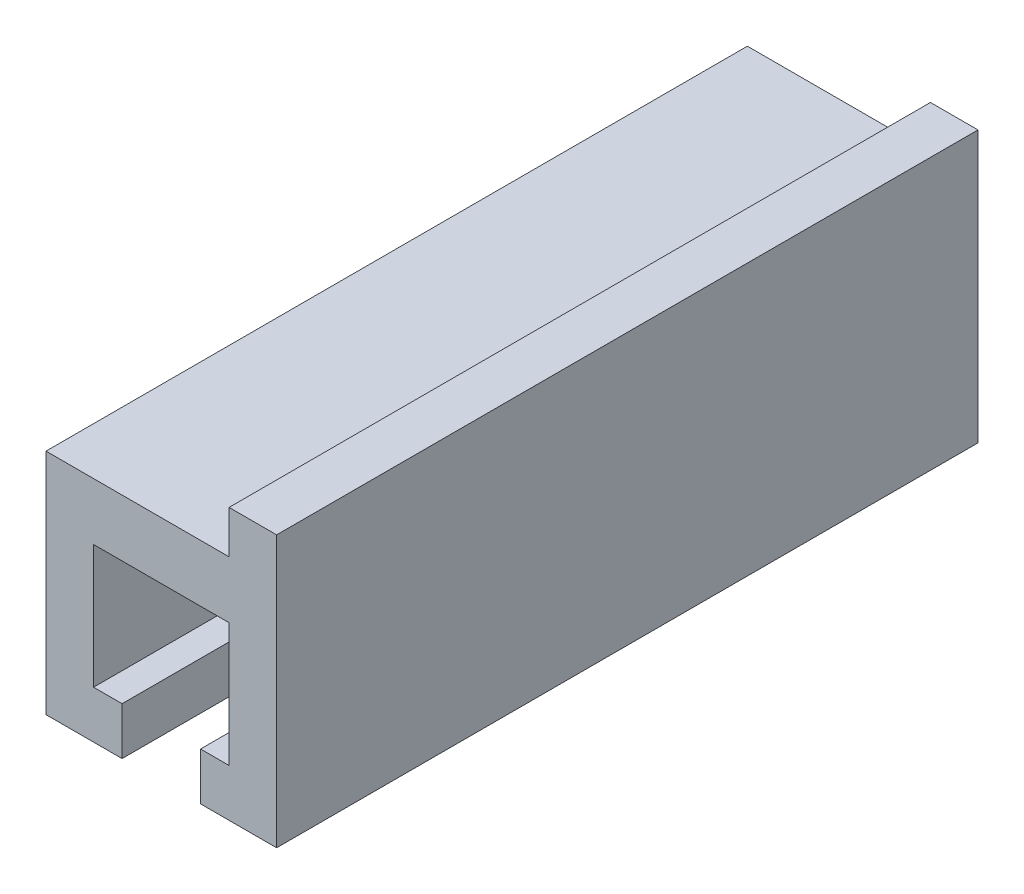
ISO-10303-21;
HEADER;
FILE_DESCRIPTION(('STEP AP214'),'2;1');
FILE_NAME('part.step','',(''),(''),'','','');
FILE_SCHEMA(('AUTOMOTIVE_DESIGN { 1 0 10303 214 1 1 1 1 }'));
ENDSEC;
DATA;
#1=APPLICATION_CONTEXT('core data for automotive mechanical design processes');
#2=APPLICATION_PROTOCOL_DEFINITION('international standard','automotive_design',2000,#1);
#3=PRODUCT_CONTEXT('',#1,'mechanical');
#4=PRODUCT('Part','Part','',(#3));
#5=PRODUCT_RELATED_PRODUCT_CATEGORY('part','',(#4));
#6=PRODUCT_DEFINITION_FORMATION('','',#4);
#7=PRODUCT_DEFINITION_CONTEXT('part definition',#1,'design');
#8=PRODUCT_DEFINITION('design','',#6,#7);
#9=PRODUCT_DEFINITION_SHAPE('','',#8);
#10=(LENGTH_UNIT() NAMED_UNIT(*) SI_UNIT(.MILLI.,.METRE.));
#11=(NAMED_UNIT(*) PLANE_ANGLE_UNIT() SI_UNIT($,.RADIAN.));
#12=(NAMED_UNIT(*) SI_UNIT($,.STERADIAN.) SOLID_ANGLE_UNIT());
#13=UNCERTAINTY_MEASURE_WITH_UNIT(LENGTH_MEASURE(1.E-05),#10,'distance_accuracy_value','');
#14=(GEOMETRIC_REPRESENTATION_CONTEXT(3) GLOBAL_UNCERTAINTY_ASSIGNED_CONTEXT((#13)) GLOBAL_UNIT_ASSIGNED_CONTEXT((#10,
#11,#12)) REPRESENTATION_CONTEXT('',''));
#15=CARTESIAN_POINT('',(0.,0.,0.));
#16=DIRECTION('',(0.,0.,1.));
#17=DIRECTION('',(1.,0.,0.));
#18=AXIS2_PLACEMENT_3D('',#15,#16,#17);
#19=CARTESIAN_POINT('',(-7.65000000000001,2.60000000000001,29.5));
#20=DIRECTION('',(0.,-1.,0.));
#21=DIRECTION('',(0.,0.,-1.));
#22=AXIS2_PLACEMENT_3D('',#19,#20,#21);
#23=PLANE('',#22);
#24=DIRECTION('',(0.,0.,1.));
#25=VECTOR('',#24,1.);
#26=CARTESIAN_POINT('',(0.0499999999999893,2.60000000000001,0.));
#27=LINE('',#26,#25);
#28=CARTESIAN_POINT('',(0.0499999999999893,2.60000000000001,0.));
#29=VERTEX_POINT('',#28);
#30=CARTESIAN_POINT('',(0.0499999999999893,2.60000000000001,29.5));
#31=VERTEX_POINT('',#30);
#32=EDGE_CURVE('E50',#29,#31,#27,.T.);
#33=ORIENTED_EDGE('',*,*,#32,.F.);
#34=DIRECTION('',(-1.,0.,0.));
#35=VECTOR('',#34,1.);
#36=CARTESIAN_POINT('',(-7.65000000000001,2.60000000000001,0.));
#37=LINE('',#36,#35);
#38=CARTESIAN_POINT('',(-7.65000000000001,2.60000000000001,0.));
#39=VERTEX_POINT('',#38);
#40=EDGE_CURVE('E97',#29,#39,#37,.T.);
#41=ORIENTED_EDGE('',*,*,#40,.T.);
#42=DIRECTION('',(0.,0.,-1.));
#43=VECTOR('',#42,1.);
#44=CARTESIAN_POINT('',(-7.65000000000001,2.60000000000001,29.5));
#45=LINE('',#44,#43);
#46=CARTESIAN_POINT('',(-7.65000000000001,2.60000000000001,29.5));
#47=VERTEX_POINT('',#46);
#48=EDGE_CURVE('E162',#47,#39,#45,.T.);
#49=ORIENTED_EDGE('',*,*,#48,.F.);
#50=DIRECTION('',(-1.,0.,0.));
#51=VECTOR('',#50,1.);
#52=CARTESIAN_POINT('',(-7.65000000000001,2.60000000000001,29.5));
#53=LINE('',#52,#51);
#54=EDGE_CURVE('E58',#31,#47,#53,.T.);
#55=ORIENTED_EDGE('',*,*,#54,.F.);
#56=EDGE_LOOP('',(#33,#41,#49,#55));
#57=FACE_BOUND('',#56,.T.);
#58=ADVANCED_FACE('F35',(#57),#23,.F.);
#59=CARTESIAN_POINT('',(-7.65000000000001,2.60000000000001,29.5));
#60=DIRECTION('',(1.,0.,0.));
#61=DIRECTION('',(0.,1.,0.));
#62=AXIS2_PLACEMENT_3D('',#59,#60,#61);
#63=PLANE('',#62);
#64=DIRECTION('',(0.,-1.,0.));
#65=VECTOR('',#64,1.);
#66=CARTESIAN_POINT('',(-7.65000000000001,2.60000000000001,0.));
#67=LINE('',#66,#65);
#68=CARTESIAN_POINT('',(-7.65000000000001,-6.99999999999999,0.));
#69=VERTEX_POINT('',#68);
#70=EDGE_CURVE('E163',#39,#69,#67,.T.);
#71=ORIENTED_EDGE('',*,*,#70,.T.);
#72=DIRECTION('',(0.,0.,-1.));
#73=VECTOR('',#72,1.);
#74=CARTESIAN_POINT('',(-7.65000000000001,-6.99999999999999,29.5));
#75=LINE('',#74,#73);
#76=CARTESIAN_POINT('',(-7.65000000000001,-6.99999999999999,29.5));
#77=VERTEX_POINT('',#76);
#78=EDGE_CURVE('E11',#77,#69,#75,.T.);
#79=ORIENTED_EDGE('',*,*,#78,.F.);
#80=DIRECTION('',(0.,-1.,0.));
#81=VECTOR('',#80,1.);
#82=CARTESIAN_POINT('',(-7.65000000000001,2.60000000000001,29.5));
#83=LINE('',#82,#81);
#84=EDGE_CURVE('E187',#47,#77,#83,.T.);
#85=ORIENTED_EDGE('',*,*,#84,.F.);
#86=ORIENTED_EDGE('',*,*,#48,.T.);
#87=EDGE_LOOP('',(#71,#79,#85,#86));
#88=FACE_BOUND('',#87,.T.);
#89=ADVANCED_FACE('F37',(#88),#63,.F.);
#90=CARTESIAN_POINT('',(-7.65000000000001,-6.99999999999999,29.5));
#91=DIRECTION('',(0.,1.,0.));
#92=DIRECTION('',(0.,0.,1.));
#93=AXIS2_PLACEMENT_3D('',#90,#91,#92);
#94=PLANE('',#93);
#95=DIRECTION('',(1.,0.,0.));
#96=VECTOR('',#95,1.);
#97=CARTESIAN_POINT('',(-7.65000000000001,-6.99999999999999,0.));
#98=LINE('',#97,#96);
#99=CARTESIAN_POINT('',(-4.45000000000001,-6.99999999999999,0.));
#100=VERTEX_POINT('',#99);
#101=EDGE_CURVE('E166',#69,#100,#98,.T.);
#102=ORIENTED_EDGE('',*,*,#101,.T.);
#103=DIRECTION('',(0.,0.,-1.));
#104=VECTOR('',#103,1.);
#105=CARTESIAN_POINT('',(-4.45000000000001,-6.99999999999999,29.5));
#106=LINE('',#105,#104);
#107=CARTESIAN_POINT('',(-4.45000000000001,-6.99999999999999,29.5));
#108=VERTEX_POINT('',#107);
#109=EDGE_CURVE('E43',#108,#100,#106,.T.);
#110=ORIENTED_EDGE('',*,*,#109,.F.);
#111=DIRECTION('',(1.,0.,0.));
#112=VECTOR('',#111,1.);
#113=CARTESIAN_POINT('',(-7.65000000000001,-6.99999999999999,29.5));
#114=LINE('',#113,#112);
#115=EDGE_CURVE('E105',#77,#108,#114,.T.);
#116=ORIENTED_EDGE('',*,*,#115,.F.);
#117=ORIENTED_EDGE('',*,*,#78,.T.);
#118=EDGE_LOOP('',(#102,#110,#116,#117));
#119=FACE_BOUND('',#118,.T.);
#120=ADVANCED_FACE('F285',(#119),#94,.F.);
#121=CARTESIAN_POINT('',(-4.45000000000001,-6.99999999999999,29.5));
#122=DIRECTION('',(-1.,0.,0.));
#123=DIRECTION('',(0.,0.,1.));
#124=AXIS2_PLACEMENT_3D('',#121,#122,#123);
#125=PLANE('',#124);
#126=DIRECTION('',(0.,1.,0.));
#127=VECTOR('',#126,1.);
#128=CARTESIAN_POINT('',(-4.45000000000001,-6.99999999999999,0.));
#129=LINE('',#128,#127);
#130=CARTESIAN_POINT('',(-4.45000000000001,-4.99999999999999,0.));
#131=VERTEX_POINT('',#130);
#132=EDGE_CURVE('E168',#100,#131,#129,.T.);
#133=ORIENTED_EDGE('',*,*,#132,.T.);
#134=DIRECTION('',(0.,0.,-1.));
#135=VECTOR('',#134,1.);
#136=CARTESIAN_POINT('',(-4.45000000000001,-4.99999999999999,29.5));
#137=LINE('',#136,#135);
#138=CARTESIAN_POINT('',(-4.45000000000001,-4.99999999999999,29.5));
#139=VERTEX_POINT('',#138);
#140=EDGE_CURVE('E203',#139,#131,#137,.T.);
#141=ORIENTED_EDGE('',*,*,#140,.F.);
#142=DIRECTION('',(0.,1.,0.));
#143=VECTOR('',#142,1.);
#144=CARTESIAN_POINT('',(-4.45000000000001,-6.99999999999999,29.5));
#145=LINE('',#144,#143);
#146=EDGE_CURVE('E211',#108,#139,#145,.T.);
#147=ORIENTED_EDGE('',*,*,#146,.F.);
#148=ORIENTED_EDGE('',*,*,#109,.T.);
#149=EDGE_LOOP('',(#133,#141,#147,#148));
#150=FACE_BOUND('',#149,.T.);
#151=ADVANCED_FACE('F209',(#150),#125,.F.);
#152=CARTESIAN_POINT('',(-4.45000000000001,-4.99999999999999,29.5));
#153=DIRECTION('',(0.,-1.,0.));
#154=DIRECTION('',(0.,0.,-1.));
#155=AXIS2_PLACEMENT_3D('',#152,#153,#154);
#156=PLANE('',#155);
#157=DIRECTION('',(-1.,0.,0.));
#158=VECTOR('',#157,1.);
#159=CARTESIAN_POINT('',(-4.45000000000001,-4.99999999999999,0.));
#160=LINE('',#159,#158);
#161=CARTESIAN_POINT('',(-5.65000000000001,-4.99999999999999,0.));
#162=VERTEX_POINT('',#161);
#163=EDGE_CURVE('E170',#131,#162,#160,.T.);
#164=ORIENTED_EDGE('',*,*,#163,.T.);
#165=DIRECTION('',(0.,0.,-1.));
#166=VECTOR('',#165,1.);
#167=CARTESIAN_POINT('',(-5.65000000000001,-4.99999999999999,29.5));
#168=LINE('',#167,#166);
#169=CARTESIAN_POINT('',(-5.65000000000001,-4.99999999999999,29.5));
#170=VERTEX_POINT('',#169);
#171=EDGE_CURVE('E200',#170,#162,#168,.T.);
#172=ORIENTED_EDGE('',*,*,#171,.F.);
#173=DIRECTION('',(-1.,0.,0.));
#174=VECTOR('',#173,1.);
#175=CARTESIAN_POINT('',(-4.45000000000001,-4.99999999999999,29.5));
#176=LINE('',#175,#174);
#177=EDGE_CURVE('E229',#139,#170,#176,.T.);
#178=ORIENTED_EDGE('',*,*,#177,.F.);
#179=ORIENTED_EDGE('',*,*,#140,.T.);
#180=EDGE_LOOP('',(#164,#172,#178,#179));
#181=FACE_BOUND('',#180,.T.);
#182=ADVANCED_FACE('F220',(#181),#156,.F.);
#183=CARTESIAN_POINT('',(-5.65000000000001,-4.99999999999999,29.5));
#184=DIRECTION('',(-1.,0.,0.));
#185=DIRECTION('',(0.,0.,1.));
#186=AXIS2_PLACEMENT_3D('',#183,#184,#185);
#187=PLANE('',#186);
#188=DIRECTION('',(0.,1.,0.));
#189=VECTOR('',#188,1.);
#190=CARTESIAN_POINT('',(-5.65000000000001,-4.99999999999999,0.));
#191=LINE('',#190,#189);
#192=CARTESIAN_POINT('',(-5.65000000000001,0.200000000000009,0.));
#193=VERTEX_POINT('',#192);
#194=EDGE_CURVE('E172',#162,#193,#191,.T.);
#195=ORIENTED_EDGE('',*,*,#194,.T.);
#196=DIRECTION('',(0.,0.,-1.));
#197=VECTOR('',#196,1.);
#198=CARTESIAN_POINT('',(-5.65000000000001,0.200000000000009,29.5));
#199=LINE('',#198,#197);
#200=CARTESIAN_POINT('',(-5.65000000000001,0.200000000000009,29.5));
#201=VERTEX_POINT('',#200);
#202=EDGE_CURVE('E197',#201,#193,#199,.T.);
#203=ORIENTED_EDGE('',*,*,#202,.F.);
#204=DIRECTION('',(0.,1.,0.));
#205=VECTOR('',#204,1.);
#206=CARTESIAN_POINT('',(-5.65000000000001,-4.99999999999999,29.5));
#207=LINE('',#206,#205);
#208=EDGE_CURVE('E226',#170,#201,#207,.T.);
#209=ORIENTED_EDGE('',*,*,#208,.F.);
#210=ORIENTED_EDGE('',*,*,#171,.T.);
#211=EDGE_LOOP('',(#195,#203,#209,#210));
#212=FACE_BOUND('',#211,.T.);
#213=ADVANCED_FACE('F224',(#212),#187,.F.);
#214=CARTESIAN_POINT('',(-5.65000000000001,0.200000000000009,29.5));
#215=DIRECTION('',(0.,1.,0.));
#216=DIRECTION('',(0.,0.,1.));
#217=AXIS2_PLACEMENT_3D('',#214,#215,#216);
#218=PLANE('',#217);
#219=DIRECTION('',(1.,0.,0.));
#220=VECTOR('',#219,1.);
#221=CARTESIAN_POINT('',(-5.65000000000001,0.200000000000009,0.));
#222=LINE('',#221,#220);
#223=CARTESIAN_POINT('',(0.0499999999999928,0.200000000000009,0.));
#224=VERTEX_POINT('',#223);
#225=EDGE_CURVE('E174',#193,#224,#222,.T.);
#226=ORIENTED_EDGE('',*,*,#225,.T.);
#227=DIRECTION('',(0.,0.,-1.));
#228=VECTOR('',#227,1.);
#229=CARTESIAN_POINT('',(0.0499999999999928,0.200000000000009,29.5));
#230=LINE('',#229,#228);
#231=CARTESIAN_POINT('',(0.0499999999999928,0.200000000000009,29.5));
#232=VERTEX_POINT('',#231);
#233=EDGE_CURVE('E194',#232,#224,#230,.T.);
#234=ORIENTED_EDGE('',*,*,#233,.F.);
#235=DIRECTION('',(1.,0.,0.));
#236=VECTOR('',#235,1.);
#237=CARTESIAN_POINT('',(-5.65000000000001,0.200000000000009,29.5));
#238=LINE('',#237,#236);
#239=EDGE_CURVE('E228',#201,#232,#238,.T.);
#240=ORIENTED_EDGE('',*,*,#239,.F.);
#241=ORIENTED_EDGE('',*,*,#202,.T.);
#242=EDGE_LOOP('',(#226,#234,#240,#241));
#243=FACE_BOUND('',#242,.T.);
#244=ADVANCED_FACE('F309',(#243),#218,.F.);
#245=CARTESIAN_POINT('',(0.0499999999999928,0.200000000000009,29.5));
#246=DIRECTION('',(1.,0.,0.));
#247=DIRECTION('',(0.,0.,-1.));
#248=AXIS2_PLACEMENT_3D('',#245,#246,#247);
#249=PLANE('',#248);
#250=DIRECTION('',(0.,-1.,0.));
#251=VECTOR('',#250,1.);
#252=CARTESIAN_POINT('',(0.0499999999999928,0.200000000000009,0.));
#253=LINE('',#252,#251);
#254=CARTESIAN_POINT('',(0.0499999999999928,-4.99999999999999,0.));
#255=VERTEX_POINT('',#254);
#256=EDGE_CURVE('E176',#224,#255,#253,.T.);
#257=ORIENTED_EDGE('',*,*,#256,.T.);
#258=DIRECTION('',(0.,0.,-1.));
#259=VECTOR('',#258,1.);
#260=CARTESIAN_POINT('',(0.0499999999999928,-4.99999999999999,29.5));
#261=LINE('',#260,#259);
#262=CARTESIAN_POINT('',(0.0499999999999928,-4.99999999999999,29.5));
#263=VERTEX_POINT('',#262);
#264=EDGE_CURVE('E191',#263,#255,#261,.T.);
#265=ORIENTED_EDGE('',*,*,#264,.F.);
#266=DIRECTION('',(0.,-1.,0.));
#267=VECTOR('',#266,1.);
#268=CARTESIAN_POINT('',(0.0499999999999928,0.200000000000009,29.5));
#269=LINE('',#268,#267);
#270=EDGE_CURVE('E231',#232,#263,#269,.T.);
#271=ORIENTED_EDGE('',*,*,#270,.F.);
#272=ORIENTED_EDGE('',*,*,#233,.T.);
#273=EDGE_LOOP('',(#257,#265,#271,#272));
#274=FACE_BOUND('',#273,.T.);
#275=ADVANCED_FACE('F240',(#274),#249,.F.);
#276=CARTESIAN_POINT('',(0.0499999999999928,-4.99999999999999,29.5));
#277=DIRECTION('',(0.,-1.,0.));
#278=DIRECTION('',(0.,0.,-1.));
#279=AXIS2_PLACEMENT_3D('',#276,#277,#278);
#280=PLANE('',#279);
#281=DIRECTION('',(-1.,0.,0.));
#282=VECTOR('',#281,1.);
#283=CARTESIAN_POINT('',(0.0499999999999928,-4.99999999999999,0.));
#284=LINE('',#283,#282);
#285=CARTESIAN_POINT('',(-1.15000000000001,-4.99999999999999,0.));
#286=VERTEX_POINT('',#285);
#287=EDGE_CURVE('E178',#255,#286,#284,.T.);
#288=ORIENTED_EDGE('',*,*,#287,.T.);
#289=DIRECTION('',(0.,0.,-1.));
#290=VECTOR('',#289,1.);
#291=CARTESIAN_POINT('',(-1.15000000000001,-4.99999999999999,29.5));
#292=LINE('',#291,#290);
#293=CARTESIAN_POINT('',(-1.15000000000001,-4.99999999999999,29.5));
#294=VERTEX_POINT('',#293);
#295=EDGE_CURVE('E150',#294,#286,#292,.T.);
#296=ORIENTED_EDGE('',*,*,#295,.F.);
#297=DIRECTION('',(-1.,0.,0.));
#298=VECTOR('',#297,1.);
#299=CARTESIAN_POINT('',(0.0499999999999928,-4.99999999999999,29.5));
#300=LINE('',#299,#298);
#301=EDGE_CURVE('E138',#263,#294,#300,.T.);
#302=ORIENTED_EDGE('',*,*,#301,.F.);
#303=ORIENTED_EDGE('',*,*,#264,.T.);
#304=EDGE_LOOP('',(#288,#296,#302,#303));
#305=FACE_BOUND('',#304,.T.);
#306=ADVANCED_FACE('F244',(#305),#280,.F.);
#307=CARTESIAN_POINT('',(-1.15000000000001,-4.99999999999999,29.5));
#308=DIRECTION('',(1.,0.,0.));
#309=DIRECTION('',(0.,0.,-1.));
#310=AXIS2_PLACEMENT_3D('',#307,#308,#309);
#311=PLANE('',#310);
#312=DIRECTION('',(0.,-1.,0.));
#313=VECTOR('',#312,1.);
#314=CARTESIAN_POINT('',(-1.15000000000001,-4.99999999999999,0.));
#315=LINE('',#314,#313);
#316=CARTESIAN_POINT('',(-1.15000000000001,-6.99999999999999,0.));
#317=VERTEX_POINT('',#316);
#318=EDGE_CURVE('E147',#286,#317,#315,.T.);
#319=ORIENTED_EDGE('',*,*,#318,.T.);
#320=DIRECTION('',(0.,0.,-1.));
#321=VECTOR('',#320,1.);
#322=CARTESIAN_POINT('',(-1.15000000000001,-6.99999999999999,29.5));
#323=LINE('',#322,#321);
#324=CARTESIAN_POINT('',(-1.15000000000001,-6.99999999999999,29.5));
#325=VERTEX_POINT('',#324);
#326=EDGE_CURVE('E144',#325,#317,#323,.T.);
#327=ORIENTED_EDGE('',*,*,#326,.F.);
#328=DIRECTION('',(0.,-1.,0.));
#329=VECTOR('',#328,1.);
#330=CARTESIAN_POINT('',(-1.15000000000001,-4.99999999999999,29.5));
#331=LINE('',#330,#329);
#332=EDGE_CURVE('E130',#294,#325,#331,.T.);
#333=ORIENTED_EDGE('',*,*,#332,.F.);
#334=ORIENTED_EDGE('',*,*,#295,.T.);
#335=EDGE_LOOP('',(#319,#327,#333,#334));
#336=FACE_BOUND('',#335,.T.);
#337=ADVANCED_FACE('F145',(#336),#311,.F.);
#338=CARTESIAN_POINT('',(2.04999999999999,-6.99999999999999,29.5));
#339=DIRECTION('',(0.,1.,0.));
#340=DIRECTION('',(0.,0.,1.));
#341=AXIS2_PLACEMENT_3D('',#338,#339,#340);
#342=PLANE('',#341);
#343=DIRECTION('',(1.,0.,0.));
#344=VECTOR('',#343,1.);
#345=CARTESIAN_POINT('',(2.04999999999999,-6.99999999999999,0.));
#346=LINE('',#345,#344);
#347=CARTESIAN_POINT('',(2.04999999999999,-6.99999999999999,0.));
#348=VERTEX_POINT('',#347);
#349=EDGE_CURVE('E181',#317,#348,#346,.T.);
#350=ORIENTED_EDGE('',*,*,#349,.T.);
#351=DIRECTION('',(0.,0.,-1.));
#352=VECTOR('',#351,1.);
#353=CARTESIAN_POINT('',(2.04999999999999,-6.99999999999999,29.5));
#354=LINE('',#353,#352);
#355=CARTESIAN_POINT('',(2.04999999999999,-6.99999999999999,29.5));
#356=VERTEX_POINT('',#355);
#357=EDGE_CURVE('E151',#356,#348,#354,.T.);
#358=ORIENTED_EDGE('',*,*,#357,.F.);
#359=DIRECTION('',(1.,0.,0.));
#360=VECTOR('',#359,1.);
#361=CARTESIAN_POINT('',(2.04999999999999,-6.99999999999999,29.5));
#362=LINE('',#361,#360);
#363=EDGE_CURVE('E135',#325,#356,#362,.T.);
#364=ORIENTED_EDGE('',*,*,#363,.F.);
#365=ORIENTED_EDGE('',*,*,#326,.T.);
#366=EDGE_LOOP('',(#350,#358,#364,#365));
#367=FACE_BOUND('',#366,.T.);
#368=ADVANCED_FACE('F153',(#367),#342,.F.);
#369=CARTESIAN_POINT('',(2.04999999999999,2.60000000000001,29.5));
#370=DIRECTION('',(-1.,0.,0.));
#371=DIRECTION('',(0.,-1.,0.));
#372=AXIS2_PLACEMENT_3D('',#369,#370,#371);
#373=PLANE('',#372);
#374=DIRECTION('',(0.,1.,0.));
#375=VECTOR('',#374,1.);
#376=CARTESIAN_POINT('',(2.04999999999999,2.60000000000001,0.));
#377=LINE('',#376,#375);
#378=CARTESIAN_POINT('',(2.04999999999999,4.40000000000001,0.));
#379=VERTEX_POINT('',#378);
#380=EDGE_CURVE('E183',#348,#379,#377,.T.);
#381=ORIENTED_EDGE('',*,*,#380,.T.);
#382=DIRECTION('',(0.,0.,1.));
#383=VECTOR('',#382,1.);
#384=CARTESIAN_POINT('',(2.04999999999999,4.40000000000001,0.));
#385=LINE('',#384,#383);
#386=CARTESIAN_POINT('',(2.04999999999999,4.40000000000001,29.5));
#387=VERTEX_POINT('',#386);
#388=EDGE_CURVE('E253',#379,#387,#385,.T.);
#389=ORIENTED_EDGE('',*,*,#388,.T.);
#390=DIRECTION('',(0.,1.,0.));
#391=VECTOR('',#390,1.);
#392=CARTESIAN_POINT('',(2.04999999999999,2.60000000000001,29.5));
#393=LINE('',#392,#391);
#394=EDGE_CURVE('E156',#356,#387,#393,.T.);
#395=ORIENTED_EDGE('',*,*,#394,.F.);
#396=ORIENTED_EDGE('',*,*,#357,.T.);
#397=EDGE_LOOP('',(#381,#389,#395,#396));
#398=FACE_BOUND('',#397,.T.);
#399=ADVANCED_FACE('F248',(#398),#373,.F.);
#400=CARTESIAN_POINT('',(0.,0.,29.5));
#401=DIRECTION('',(0.,0.,1.));
#402=DIRECTION('',(1.,0.,0.));
#403=AXIS2_PLACEMENT_3D('',#400,#401,#402);
#404=PLANE('',#403);
#405=ORIENTED_EDGE('',*,*,#84,.T.);
#406=ORIENTED_EDGE('',*,*,#115,.T.);
#407=ORIENTED_EDGE('',*,*,#146,.T.);
#408=ORIENTED_EDGE('',*,*,#177,.T.);
#409=ORIENTED_EDGE('',*,*,#208,.T.);
#410=ORIENTED_EDGE('',*,*,#239,.T.);
#411=ORIENTED_EDGE('',*,*,#270,.T.);
#412=ORIENTED_EDGE('',*,*,#301,.T.);
#413=ORIENTED_EDGE('',*,*,#332,.T.);
#414=ORIENTED_EDGE('',*,*,#363,.T.);
#415=ORIENTED_EDGE('',*,*,#394,.T.);
#416=DIRECTION('',(-1.,0.,0.));
#417=VECTOR('',#416,1.);
#418=CARTESIAN_POINT('',(2.04999999999999,4.40000000000001,29.5));
#419=LINE('',#418,#417);
#420=CARTESIAN_POINT('',(0.0499999999999893,4.40000000000001,29.5));
#421=VERTEX_POINT('',#420);
#422=EDGE_CURVE('E257',#387,#421,#419,.T.);
#423=ORIENTED_EDGE('',*,*,#422,.T.);
#424=DIRECTION('',(0.,-1.,0.));
#425=VECTOR('',#424,1.);
#426=CARTESIAN_POINT('',(0.0499999999999893,2.60000000000001,29.5));
#427=LINE('',#426,#425);
#428=EDGE_CURVE('E268',#421,#31,#427,.T.);
#429=ORIENTED_EDGE('',*,*,#428,.T.);
#430=ORIENTED_EDGE('',*,*,#54,.T.);
#431=EDGE_LOOP('',(#405,#406,#407,#408,#409,#410,#411,#412,#413,#414,#415,#423,#429,#430));
#432=FACE_BOUND('',#431,.T.);
#433=ADVANCED_FACE('F132',(#432),#404,.T.);
#434=CARTESIAN_POINT('',(0.,0.,0.));
#435=DIRECTION('',(0.,0.,1.));
#436=DIRECTION('',(1.,0.,0.));
#437=AXIS2_PLACEMENT_3D('',#434,#435,#436);
#438=PLANE('',#437);
#439=ORIENTED_EDGE('',*,*,#70,.F.);
#440=ORIENTED_EDGE('',*,*,#40,.F.);
#441=DIRECTION('',(0.,-1.,0.));
#442=VECTOR('',#441,1.);
#443=CARTESIAN_POINT('',(0.0499999999999893,2.60000000000001,0.));
#444=LINE('',#443,#442);
#445=CARTESIAN_POINT('',(0.0499999999999893,4.40000000000001,0.));
#446=VERTEX_POINT('',#445);
#447=EDGE_CURVE('E270',#446,#29,#444,.T.);
#448=ORIENTED_EDGE('',*,*,#447,.F.);
#449=DIRECTION('',(-1.,0.,0.));
#450=VECTOR('',#449,1.);
#451=CARTESIAN_POINT('',(2.04999999999999,4.40000000000001,0.));
#452=LINE('',#451,#450);
#453=EDGE_CURVE('E273',#379,#446,#452,.T.);
#454=ORIENTED_EDGE('',*,*,#453,.F.);
#455=ORIENTED_EDGE('',*,*,#380,.F.);
#456=ORIENTED_EDGE('',*,*,#349,.F.);
#457=ORIENTED_EDGE('',*,*,#318,.F.);
#458=ORIENTED_EDGE('',*,*,#287,.F.);
#459=ORIENTED_EDGE('',*,*,#256,.F.);
#460=ORIENTED_EDGE('',*,*,#225,.F.);
#461=ORIENTED_EDGE('',*,*,#194,.F.);
#462=ORIENTED_EDGE('',*,*,#163,.F.);
#463=ORIENTED_EDGE('',*,*,#132,.F.);
#464=ORIENTED_EDGE('',*,*,#101,.F.);
#465=EDGE_LOOP('',(#439,#440,#448,#454,#455,#456,#457,#458,#459,#460,#461,#462,#463,#464));
#466=FACE_BOUND('',#465,.T.);
#467=ADVANCED_FACE('F215',(#466),#438,.F.);
#468=CARTESIAN_POINT('',(0.0499999999999893,2.60000000000001,0.));
#469=DIRECTION('',(-1.,0.,0.));
#470=DIRECTION('',(0.,0.,1.));
#471=AXIS2_PLACEMENT_3D('',#468,#469,#470);
#472=PLANE('',#471);
#473=ORIENTED_EDGE('',*,*,#428,.F.);
#474=DIRECTION('',(0.,0.,1.));
#475=VECTOR('',#474,1.);
#476=CARTESIAN_POINT('',(0.0499999999999893,4.40000000000001,0.));
#477=LINE('',#476,#475);
#478=EDGE_CURVE('E271',#446,#421,#477,.T.);
#479=ORIENTED_EDGE('',*,*,#478,.F.);
#480=ORIENTED_EDGE('',*,*,#447,.T.);
#481=ORIENTED_EDGE('',*,*,#32,.T.);
#482=EDGE_LOOP('',(#473,#479,#480,#481));
#483=FACE_BOUND('',#482,.T.);
#484=ADVANCED_FACE('F267',(#483),#472,.T.);
#485=CARTESIAN_POINT('',(2.04999999999999,4.40000000000001,0.));
#486=DIRECTION('',(0.,1.,0.));
#487=DIRECTION('',(-1.,0.,0.));
#488=AXIS2_PLACEMENT_3D('',#485,#486,#487);
#489=PLANE('',#488);
#490=ORIENTED_EDGE('',*,*,#422,.F.);
#491=ORIENTED_EDGE('',*,*,#388,.F.);
#492=ORIENTED_EDGE('',*,*,#453,.T.);
#493=ORIENTED_EDGE('',*,*,#478,.T.);
#494=EDGE_LOOP('',(#490,#491,#492,#493));
#495=FACE_BOUND('',#494,.T.);
#496=ADVANCED_FACE('F364',(#495),#489,.T.);
#497=CLOSED_SHELL('',(#58,#89,#120,#151,#182,#213,#244,#275,#306,#337,#368,#399,#433,#467,#484,#496));
#498=MANIFOLD_SOLID_BREP('B2',#497);
#499=ADVANCED_BREP_SHAPE_REPRESENTATION('',(#18,#498),#14);
#500=SHAPE_DEFINITION_REPRESENTATION(#9,#499);
ENDSEC;
END-ISO-10303-21;
